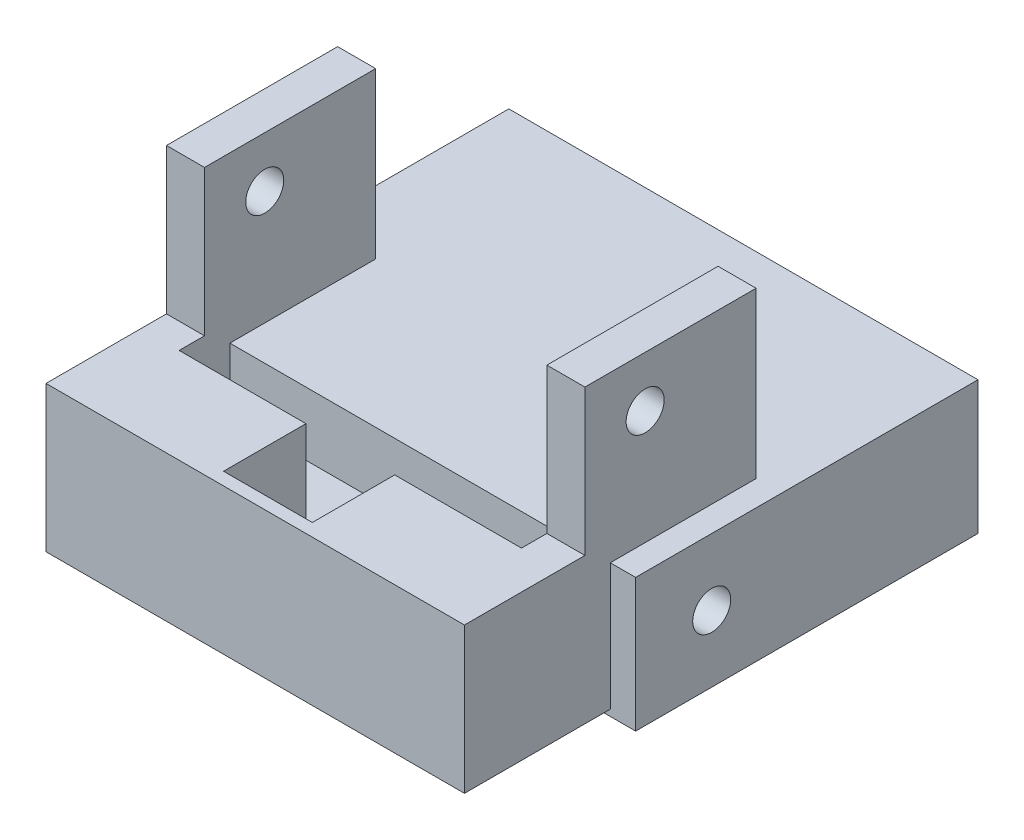
ISO-10303-21;
HEADER;
FILE_DESCRIPTION(('STEP AP214'),'2;1');
FILE_NAME('part.step','',(''),(''),'','','');
FILE_SCHEMA(('AUTOMOTIVE_DESIGN { 1 0 10303 214 1 1 1 1 }'));
ENDSEC;
DATA;
#1=APPLICATION_CONTEXT('core data for automotive mechanical design processes');
#2=APPLICATION_PROTOCOL_DEFINITION('international standard','automotive_design',2000,#1);
#3=PRODUCT_CONTEXT('',#1,'mechanical');
#4=PRODUCT('Part','Part','',(#3));
#5=PRODUCT_RELATED_PRODUCT_CATEGORY('part','',(#4));
#6=PRODUCT_DEFINITION_FORMATION('','',#4);
#7=PRODUCT_DEFINITION_CONTEXT('part definition',#1,'design');
#8=PRODUCT_DEFINITION('design','',#6,#7);
#9=PRODUCT_DEFINITION_SHAPE('','',#8);
#10=(LENGTH_UNIT() NAMED_UNIT(*) SI_UNIT(.MILLI.,.METRE.));
#11=(NAMED_UNIT(*) PLANE_ANGLE_UNIT() SI_UNIT($,.RADIAN.));
#12=(NAMED_UNIT(*) SI_UNIT($,.STERADIAN.) SOLID_ANGLE_UNIT());
#13=UNCERTAINTY_MEASURE_WITH_UNIT(LENGTH_MEASURE(1.E-05),#10,'distance_accuracy_value','');
#14=(GEOMETRIC_REPRESENTATION_CONTEXT(3) GLOBAL_UNCERTAINTY_ASSIGNED_CONTEXT((#13)) GLOBAL_UNIT_ASSIGNED_CONTEXT((#10,
#11,#12)) REPRESENTATION_CONTEXT('',''));
#15=CARTESIAN_POINT('',(0.,0.,0.));
#16=DIRECTION('',(0.,0.,1.));
#17=DIRECTION('',(1.,0.,0.));
#18=AXIS2_PLACEMENT_3D('',#15,#16,#17);
#19=CARTESIAN_POINT('',(558.894917120642,82.3157017452683,-224.056360518351));
#20=DIRECTION('',(-1.,0.,0.));
#21=DIRECTION('',(0.,0.,1.));
#22=AXIS2_PLACEMENT_3D('',#19,#20,#21);
#23=PLANE('',#22);
#24=DIRECTION('',(0.,0.,1.));
#25=VECTOR('',#24,1.);
#26=CARTESIAN_POINT('',(558.894917120642,85.3157017452683,-58.6570709718798));
#27=LINE('',#26,#25);
#28=CARTESIAN_POINT('',(558.894917120642,85.3157017452683,-224.056360518351));
#29=VERTEX_POINT('',#28);
#30=CARTESIAN_POINT('',(558.894917120642,85.3157017452683,-211.056360518351));
#31=VERTEX_POINT('',#30);
#32=EDGE_CURVE('E282',#29,#31,#27,.T.);
#33=ORIENTED_EDGE('',*,*,#32,.F.);
#34=DIRECTION('',(0.,1.,0.));
#35=VECTOR('',#34,1.);
#36=CARTESIAN_POINT('',(558.894917120642,82.3157017452683,-224.056360518351));
#37=LINE('',#36,#35);
#38=CARTESIAN_POINT('',(558.894917120642,72.3157017452683,-224.056360518351));
#39=VERTEX_POINT('',#38);
#40=EDGE_CURVE('E208',#39,#29,#37,.T.);
#41=ORIENTED_EDGE('',*,*,#40,.F.);
#42=DIRECTION('',(0.,0.,-1.));
#43=VECTOR('',#42,1.);
#44=CARTESIAN_POINT('',(558.894917120642,72.3157017452683,-213.504816335202));
#45=LINE('',#44,#43);
#46=CARTESIAN_POINT('',(558.894917120642,72.3157017452683,-211.056360518351));
#47=VERTEX_POINT('',#46);
#48=EDGE_CURVE('E200',#39,#47,#45,.F.);
#49=ORIENTED_EDGE('',*,*,#48,.T.);
#50=DIRECTION('',(0.,1.,0.));
#51=VECTOR('',#50,1.);
#52=CARTESIAN_POINT('',(558.894917120642,82.3157017452683,-211.056360518351));
#53=LINE('',#52,#51);
#54=EDGE_CURVE('E175',#31,#47,#53,.F.);
#55=ORIENTED_EDGE('',*,*,#54,.F.);
#56=EDGE_LOOP('',(#33,#41,#49,#55));
#57=FACE_BOUND('',#56,.T.);
#58=ADVANCED_FACE('F17',(#57),#23,.T.);
#59=CARTESIAN_POINT('',(558.894917120642,82.3157017452683,-211.056360518351));
#60=DIRECTION('',(0.,0.,-1.));
#61=DIRECTION('',(-1.,0.,0.));
#62=AXIS2_PLACEMENT_3D('',#59,#60,#61);
#63=PLANE('',#62);
#64=DIRECTION('',(0.,1.,0.));
#65=VECTOR('',#64,1.);
#66=CARTESIAN_POINT('',(544.894917120642,82.3157017452683,-211.056360518351));
#67=LINE('',#66,#65);
#68=CARTESIAN_POINT('',(544.894917120642,85.3157017452683,-211.056360518351));
#69=VERTEX_POINT('',#68);
#70=CARTESIAN_POINT('',(544.894917120642,72.3157017452683,-211.056360518351));
#71=VERTEX_POINT('',#70);
#72=EDGE_CURVE('E192',#69,#71,#67,.F.);
#73=ORIENTED_EDGE('',*,*,#72,.F.);
#74=DIRECTION('',(1.,0.,0.));
#75=VECTOR('',#74,1.);
#76=CARTESIAN_POINT('',(556.61416335875,85.3157017452683,-211.056360518351));
#77=LINE('',#76,#75);
#78=EDGE_CURVE('E280',#31,#69,#77,.F.);
#79=ORIENTED_EDGE('',*,*,#78,.F.);
#80=ORIENTED_EDGE('',*,*,#54,.T.);
#81=DIRECTION('',(1.,0.,0.));
#82=VECTOR('',#81,1.);
#83=CARTESIAN_POINT('',(580.438463796927,72.3157017452683,-211.056360518351));
#84=LINE('',#83,#82);
#85=EDGE_CURVE('E205',#47,#71,#84,.F.);
#86=ORIENTED_EDGE('',*,*,#85,.T.);
#87=EDGE_LOOP('',(#73,#79,#80,#86));
#88=FACE_BOUND('',#87,.T.);
#89=ADVANCED_FACE('F303',(#88),#63,.T.);
#90=CARTESIAN_POINT('',(544.894917120642,82.3157017452683,-211.056360518351));
#91=DIRECTION('',(1.,0.,0.));
#92=DIRECTION('',(0.,0.,-1.));
#93=AXIS2_PLACEMENT_3D('',#90,#91,#92);
#94=PLANE('',#93);
#95=DIRECTION('',(0.,0.,1.));
#96=VECTOR('',#95,1.);
#97=CARTESIAN_POINT('',(544.894917120642,85.3157017452683,-58.6570709718798));
#98=LINE('',#97,#96);
#99=CARTESIAN_POINT('',(544.894917120642,85.3157017452683,-224.056360518351));
#100=VERTEX_POINT('',#99);
#101=EDGE_CURVE('E278',#69,#100,#98,.F.);
#102=ORIENTED_EDGE('',*,*,#101,.F.);
#103=ORIENTED_EDGE('',*,*,#72,.T.);
#104=DIRECTION('',(0.,0.,-1.));
#105=VECTOR('',#104,1.);
#106=CARTESIAN_POINT('',(544.894917120642,72.3157017452683,-213.504816335202));
#107=LINE('',#106,#105);
#108=CARTESIAN_POINT('',(544.894917120642,72.3157017452683,-224.056360518351));
#109=VERTEX_POINT('',#108);
#110=EDGE_CURVE('E197',#71,#109,#107,.T.);
#111=ORIENTED_EDGE('',*,*,#110,.T.);
#112=DIRECTION('',(0.,1.,0.));
#113=VECTOR('',#112,1.);
#114=CARTESIAN_POINT('',(544.894917120642,82.3157017452683,-224.056360518351));
#115=LINE('',#114,#113);
#116=EDGE_CURVE('E182',#100,#109,#115,.F.);
#117=ORIENTED_EDGE('',*,*,#116,.F.);
#118=EDGE_LOOP('',(#102,#103,#111,#117));
#119=FACE_BOUND('',#118,.T.);
#120=ADVANCED_FACE('F202',(#119),#94,.T.);
#121=CARTESIAN_POINT('',(524.894917120642,82.3157017452683,-224.056360518351));
#122=DIRECTION('',(0.,0.,-1.));
#123=DIRECTION('',(-1.,0.,0.));
#124=AXIS2_PLACEMENT_3D('',#121,#122,#123);
#125=PLANE('',#124);
#126=DIRECTION('',(1.,0.,0.));
#127=VECTOR('',#126,1.);
#128=CARTESIAN_POINT('',(556.61416335875,85.3157017452683,-224.056360518351));
#129=LINE('',#128,#127);
#130=CARTESIAN_POINT('',(524.894917120642,85.3157017452683,-224.056360518351));
#131=VERTEX_POINT('',#130);
#132=EDGE_CURVE('E188',#100,#131,#129,.F.);
#133=ORIENTED_EDGE('',*,*,#132,.F.);
#134=ORIENTED_EDGE('',*,*,#116,.T.);
#135=DIRECTION('',(1.,0.,0.));
#136=VECTOR('',#135,1.);
#137=CARTESIAN_POINT('',(580.438463796927,72.3157017452683,-224.056360518351));
#138=LINE('',#137,#136);
#139=CARTESIAN_POINT('',(524.894917120642,72.3157017452683,-224.056360518351));
#140=VERTEX_POINT('',#139);
#141=EDGE_CURVE('E186',#109,#140,#138,.F.);
#142=ORIENTED_EDGE('',*,*,#141,.T.);
#143=DIRECTION('',(0.,1.,0.));
#144=VECTOR('',#143,1.);
#145=CARTESIAN_POINT('',(524.894917120642,82.3157017452683,-224.056360518351));
#146=LINE('',#145,#144);
#147=EDGE_CURVE('E255',#131,#140,#146,.F.);
#148=ORIENTED_EDGE('',*,*,#147,.F.);
#149=EDGE_LOOP('',(#133,#134,#142,#148));
#150=FACE_BOUND('',#149,.T.);
#151=ADVANCED_FACE('F184',(#150),#125,.T.);
#152=CARTESIAN_POINT('',(580.438463796927,72.3157017452683,-213.504816335202));
#153=DIRECTION('',(0.,-1.,0.));
#154=DIRECTION('',(0.,0.,-1.));
#155=AXIS2_PLACEMENT_3D('',#152,#153,#154);
#156=PLANE('',#155);
#157=ORIENTED_EDGE('',*,*,#85,.F.);
#158=ORIENTED_EDGE('',*,*,#48,.F.);
#159=DIRECTION('',(-1.,0.,0.));
#160=VECTOR('',#159,1.);
#161=CARTESIAN_POINT('',(578.894917120642,72.3157017452683,-224.056360518351));
#162=LINE('',#161,#160);
#163=CARTESIAN_POINT('',(578.894917120642,72.3157017452683,-224.056360518351));
#164=VERTEX_POINT('',#163);
#165=EDGE_CURVE('E204',#164,#39,#162,.T.);
#166=ORIENTED_EDGE('',*,*,#165,.F.);
#167=DIRECTION('',(0.,0.,1.));
#168=VECTOR('',#167,1.);
#169=CARTESIAN_POINT('',(578.894917120642,72.3157017452683,-228.056360518351));
#170=LINE('',#169,#168);
#171=CARTESIAN_POINT('',(578.894917120642,72.3157017452683,-232.056360518351));
#172=VERTEX_POINT('',#171);
#173=EDGE_CURVE('E354',#172,#164,#170,.T.);
#174=ORIENTED_EDGE('',*,*,#173,.F.);
#175=DIRECTION('',(1.,0.,0.));
#176=VECTOR('',#175,1.);
#177=CARTESIAN_POINT('',(514.894917120642,72.3157017452683,-232.056360518351));
#178=LINE('',#177,#176);
#179=CARTESIAN_POINT('',(524.894917120642,72.3157017452683,-232.056360518351));
#180=VERTEX_POINT('',#179);
#181=EDGE_CURVE('E246',#180,#172,#178,.T.);
#182=ORIENTED_EDGE('',*,*,#181,.F.);
#183=DIRECTION('',(0.,0.,-1.));
#184=VECTOR('',#183,1.);
#185=CARTESIAN_POINT('',(524.894917120642,72.3157017452683,-255.056360518351));
#186=LINE('',#185,#184);
#187=EDGE_CURVE('E199',#140,#180,#186,.T.);
#188=ORIENTED_EDGE('',*,*,#187,.F.);
#189=ORIENTED_EDGE('',*,*,#141,.F.);
#190=ORIENTED_EDGE('',*,*,#110,.F.);
#191=EDGE_LOOP('',(#157,#158,#166,#174,#182,#188,#189,#190));
#192=FACE_BOUND('',#191,.T.);
#193=ADVANCED_FACE('F196',(#192),#156,.F.);
#194=CARTESIAN_POINT('',(578.894917120642,82.3157017452683,-224.056360518351));
#195=DIRECTION('',(0.,0.,-1.));
#196=DIRECTION('',(-1.,0.,0.));
#197=AXIS2_PLACEMENT_3D('',#194,#195,#196);
#198=PLANE('',#197);
#199=DIRECTION('',(1.,0.,0.));
#200=VECTOR('',#199,1.);
#201=CARTESIAN_POINT('',(556.61416335875,85.3157017452683,-224.056360518351));
#202=LINE('',#201,#200);
#203=CARTESIAN_POINT('',(578.894917120642,85.3157017452683,-224.056360518351));
#204=VERTEX_POINT('',#203);
#205=EDGE_CURVE('E284',#204,#29,#202,.F.);
#206=ORIENTED_EDGE('',*,*,#205,.F.);
#207=DIRECTION('',(0.,1.,0.));
#208=VECTOR('',#207,1.);
#209=CARTESIAN_POINT('',(578.894917120642,82.3157017452683,-224.056360518351));
#210=LINE('',#209,#208);
#211=EDGE_CURVE('E352',#164,#204,#210,.T.);
#212=ORIENTED_EDGE('',*,*,#211,.F.);
#213=ORIENTED_EDGE('',*,*,#165,.T.);
#214=ORIENTED_EDGE('',*,*,#40,.T.);
#215=EDGE_LOOP('',(#206,#212,#213,#214));
#216=FACE_BOUND('',#215,.T.);
#217=ADVANCED_FACE('F293',(#216),#198,.T.);
#218=CARTESIAN_POINT('',(507.494893120642,100.315701745268,-237.556360518351));
#219=DIRECTION('',(1.,0.,0.));
#220=DIRECTION('',(0.,0.,-1.));
#221=AXIS2_PLACEMENT_3D('',#218,#219,#220);
#222=CYLINDRICAL_SURFACE('',#221,3.);
#223=CARTESIAN_POINT('',(578.894917120642,100.315701745268,-237.556360518351));
#224=DIRECTION('',(1.,0.,0.));
#225=DIRECTION('',(0.,0.,-1.));
#226=AXIS2_PLACEMENT_3D('',#223,#224,#225);
#227=CIRCLE('',#226,3.);
#228=CARTESIAN_POINT('',(578.894917120642,100.315701745268,-240.556360518351));
#229=VERTEX_POINT('',#228);
#230=EDGE_CURVE('E236',#229,#229,#227,.T.);
#231=ORIENTED_EDGE('',*,*,#230,.F.);
#232=EDGE_LOOP('',(#231));
#233=FACE_BOUND('',#232,.T.);
#234=CARTESIAN_POINT('',(584.894917120642,100.315701745268,-237.556360518351));
#235=DIRECTION('',(1.,0.,0.));
#236=DIRECTION('',(0.,0.,-1.));
#237=AXIS2_PLACEMENT_3D('',#234,#235,#236);
#238=CIRCLE('',#237,3.);
#239=CARTESIAN_POINT('',(584.894917120642,100.315701745268,-240.556360518351));
#240=VERTEX_POINT('',#239);
#241=EDGE_CURVE('E232',#240,#240,#238,.F.);
#242=ORIENTED_EDGE('',*,*,#241,.F.);
#243=EDGE_LOOP('',(#242));
#244=FACE_BOUND('',#243,.T.);
#245=ADVANCED_FACE('F523',(#233,#244),#222,.F.);
#246=CARTESIAN_POINT('',(314.61416335875,108.315701745268,-58.6570709718798));
#247=DIRECTION('',(0.,1.,0.));
#248=DIRECTION('',(0.,0.,1.));
#249=AXIS2_PLACEMENT_3D('',#246,#247,#248);
#250=PLANE('',#249);
#251=DIRECTION('',(0.,0.,-1.));
#252=VECTOR('',#251,1.);
#253=CARTESIAN_POINT('',(584.894917120642,108.315701745268,-255.056360518351));
#254=LINE('',#253,#252);
#255=CARTESIAN_POINT('',(584.894917120642,108.315701745268,-255.056360518351));
#256=VERTEX_POINT('',#255);
#257=CARTESIAN_POINT('',(584.894917120642,108.315701745268,-228.056360518351));
#258=VERTEX_POINT('',#257);
#259=EDGE_CURVE('E341',#256,#258,#254,.F.);
#260=ORIENTED_EDGE('',*,*,#259,.F.);
#261=DIRECTION('',(-1.,0.,0.));
#262=VECTOR('',#261,1.);
#263=CARTESIAN_POINT('',(578.894917120642,108.315701745268,-255.056360518351));
#264=LINE('',#263,#262);
#265=CARTESIAN_POINT('',(578.894917120642,108.315701745268,-255.056360518351));
#266=VERTEX_POINT('',#265);
#267=EDGE_CURVE('E235',#266,#256,#264,.F.);
#268=ORIENTED_EDGE('',*,*,#267,.F.);
#269=DIRECTION('',(0.,0.,1.));
#270=VECTOR('',#269,1.);
#271=CARTESIAN_POINT('',(578.894917120642,108.315701745268,-228.056360518351));
#272=LINE('',#271,#270);
#273=CARTESIAN_POINT('',(578.894917120642,108.315701745268,-228.056360518351));
#274=VERTEX_POINT('',#273);
#275=EDGE_CURVE('E243',#274,#266,#272,.F.);
#276=ORIENTED_EDGE('',*,*,#275,.F.);
#277=DIRECTION('',(1.,0.,0.));
#278=VECTOR('',#277,1.);
#279=CARTESIAN_POINT('',(584.894917120642,108.315701745268,-228.056360518351));
#280=LINE('',#279,#278);
#281=EDGE_CURVE('E289',#258,#274,#280,.F.);
#282=ORIENTED_EDGE('',*,*,#281,.F.);
#283=EDGE_LOOP('',(#260,#268,#276,#282));
#284=FACE_BOUND('',#283,.T.);
#285=ADVANCED_FACE('F373',(#284),#250,.T.);
#286=CARTESIAN_POINT('',(584.894917120642,82.3157017452683,-228.056360518351));
#287=DIRECTION('',(0.,0.,1.));
#288=DIRECTION('',(1.,0.,0.));
#289=AXIS2_PLACEMENT_3D('',#286,#287,#288);
#290=PLANE('',#289);
#291=ORIENTED_EDGE('',*,*,#281,.T.);
#292=DIRECTION('',(0.,1.,0.));
#293=VECTOR('',#292,1.);
#294=CARTESIAN_POINT('',(578.894917120642,82.3157017452683,-228.056360518351));
#295=LINE('',#294,#293);
#296=CARTESIAN_POINT('',(578.894917120642,85.3157017452683,-228.056360518351));
#297=VERTEX_POINT('',#296);
#298=EDGE_CURVE('E238',#297,#274,#295,.T.);
#299=ORIENTED_EDGE('',*,*,#298,.F.);
#300=DIRECTION('',(1.,0.,0.));
#301=VECTOR('',#300,1.);
#302=CARTESIAN_POINT('',(556.61416335875,85.3157017452683,-228.056360518351));
#303=LINE('',#302,#301);
#304=CARTESIAN_POINT('',(584.894917120642,85.3157017452683,-228.056360518351));
#305=VERTEX_POINT('',#304);
#306=EDGE_CURVE('E287',#305,#297,#303,.F.);
#307=ORIENTED_EDGE('',*,*,#306,.F.);
#308=DIRECTION('',(0.,1.,0.));
#309=VECTOR('',#308,1.);
#310=CARTESIAN_POINT('',(584.894917120642,82.3157017452683,-228.056360518351));
#311=LINE('',#310,#309);
#312=EDGE_CURVE('E339',#258,#305,#311,.F.);
#313=ORIENTED_EDGE('',*,*,#312,.F.);
#314=EDGE_LOOP('',(#291,#299,#307,#313));
#315=FACE_BOUND('',#314,.T.);
#316=ADVANCED_FACE('F516',(#315),#290,.T.);
#317=CARTESIAN_POINT('',(507.494893120642,100.315701745268,-237.556360518351));
#318=DIRECTION('',(1.,0.,0.));
#319=DIRECTION('',(0.,0.,-1.));
#320=AXIS2_PLACEMENT_3D('',#317,#318,#319);
#321=CYLINDRICAL_SURFACE('',#320,3.);
#322=CARTESIAN_POINT('',(518.894917120642,100.315701745268,-237.556360518351));
#323=DIRECTION('',(1.,0.,0.));
#324=DIRECTION('',(0.,0.,-1.));
#325=AXIS2_PLACEMENT_3D('',#322,#323,#324);
#326=CIRCLE('',#325,3.);
#327=CARTESIAN_POINT('',(518.894917120642,100.315701745268,-240.556360518351));
#328=VERTEX_POINT('',#327);
#329=EDGE_CURVE('E227',#328,#328,#326,.T.);
#330=ORIENTED_EDGE('',*,*,#329,.F.);
#331=EDGE_LOOP('',(#330));
#332=FACE_BOUND('',#331,.T.);
#333=CARTESIAN_POINT('',(524.894917120642,100.315701745268,-237.556360518351));
#334=DIRECTION('',(1.,0.,0.));
#335=DIRECTION('',(0.,0.,-1.));
#336=AXIS2_PLACEMENT_3D('',#333,#334,#335);
#337=CIRCLE('',#336,3.);
#338=CARTESIAN_POINT('',(524.894917120642,100.315701745268,-240.556360518351));
#339=VERTEX_POINT('',#338);
#340=EDGE_CURVE('E20',#339,#339,#337,.F.);
#341=ORIENTED_EDGE('',*,*,#340,.F.);
#342=EDGE_LOOP('',(#341));
#343=FACE_BOUND('',#342,.T.);
#344=ADVANCED_FACE('F512',(#332,#343),#321,.F.);
#345=CARTESIAN_POINT('',(584.894917120642,82.3157017452683,-209.056360518351));
#346=DIRECTION('',(0.,0.,1.));
#347=DIRECTION('',(1.,0.,0.));
#348=AXIS2_PLACEMENT_3D('',#345,#346,#347);
#349=PLANE('',#348);
#350=DIRECTION('',(0.,1.,0.));
#351=VECTOR('',#350,1.);
#352=CARTESIAN_POINT('',(584.894917120642,82.3157017452683,-209.056360518351));
#353=LINE('',#352,#351);
#354=CARTESIAN_POINT('',(584.894917120642,85.3157017452683,-209.056360518351));
#355=VERTEX_POINT('',#354);
#356=CARTESIAN_POINT('',(584.894917120642,62.3157017452683,-209.056360518351));
#357=VERTEX_POINT('',#356);
#358=EDGE_CURVE('E234',#355,#357,#353,.F.);
#359=ORIENTED_EDGE('',*,*,#358,.F.);
#360=DIRECTION('',(1.,0.,0.));
#361=VECTOR('',#360,1.);
#362=CARTESIAN_POINT('',(556.61416335875,85.3157017452683,-209.056360518351));
#363=LINE('',#362,#361);
#364=CARTESIAN_POINT('',(518.894917120642,85.3157017452683,-209.056360518351));
#365=VERTEX_POINT('',#364);
#366=EDGE_CURVE('E275',#365,#355,#363,.T.);
#367=ORIENTED_EDGE('',*,*,#366,.F.);
#368=DIRECTION('',(0.,1.,0.));
#369=VECTOR('',#368,1.);
#370=CARTESIAN_POINT('',(518.894917120642,82.3157017452683,-209.056360518351));
#371=LINE('',#370,#369);
#372=CARTESIAN_POINT('',(518.894917120642,62.3157017452683,-209.056360518351));
#373=VERTEX_POINT('',#372);
#374=EDGE_CURVE('E323',#373,#365,#371,.T.);
#375=ORIENTED_EDGE('',*,*,#374,.F.);
#376=DIRECTION('',(1.,0.,0.));
#377=VECTOR('',#376,1.);
#378=CARTESIAN_POINT('',(556.61416335875,62.3157017452683,-209.056360518351));
#379=LINE('',#378,#377);
#380=EDGE_CURVE('E334',#373,#357,#379,.T.);
#381=ORIENTED_EDGE('',*,*,#380,.T.);
#382=EDGE_LOOP('',(#359,#367,#375,#381));
#383=FACE_BOUND('',#382,.T.);
#384=ADVANCED_FACE('F509',(#383),#349,.T.);
#385=CARTESIAN_POINT('',(556.61416335875,85.3157017452683,-58.6570709718798));
#386=DIRECTION('',(0.,1.,0.));
#387=DIRECTION('',(0.,0.,1.));
#388=AXIS2_PLACEMENT_3D('',#385,#386,#387);
#389=PLANE('',#388);
#390=ORIENTED_EDGE('',*,*,#366,.T.);
#391=DIRECTION('',(0.,0.,-1.));
#392=VECTOR('',#391,1.);
#393=CARTESIAN_POINT('',(584.894917120642,85.3157017452683,-255.056360518351));
#394=LINE('',#393,#392);
#395=EDGE_CURVE('E337',#305,#355,#394,.F.);
#396=ORIENTED_EDGE('',*,*,#395,.F.);
#397=ORIENTED_EDGE('',*,*,#306,.T.);
#398=DIRECTION('',(0.,0.,1.));
#399=VECTOR('',#398,1.);
#400=CARTESIAN_POINT('',(578.894917120642,85.3157017452683,-228.056360518351));
#401=LINE('',#400,#399);
#402=EDGE_CURVE('E302',#204,#297,#401,.F.);
#403=ORIENTED_EDGE('',*,*,#402,.F.);
#404=ORIENTED_EDGE('',*,*,#205,.T.);
#405=ORIENTED_EDGE('',*,*,#32,.T.);
#406=ORIENTED_EDGE('',*,*,#78,.T.);
#407=ORIENTED_EDGE('',*,*,#101,.T.);
#408=ORIENTED_EDGE('',*,*,#132,.T.);
#409=DIRECTION('',(0.,0.,-1.));
#410=VECTOR('',#409,1.);
#411=CARTESIAN_POINT('',(524.894917120642,85.3157017452683,-255.056360518351));
#412=LINE('',#411,#410);
#413=CARTESIAN_POINT('',(524.894917120642,85.3157017452683,-228.056360518351));
#414=VERTEX_POINT('',#413);
#415=EDGE_CURVE('E257',#414,#131,#412,.F.);
#416=ORIENTED_EDGE('',*,*,#415,.F.);
#417=DIRECTION('',(1.,0.,0.));
#418=VECTOR('',#417,1.);
#419=CARTESIAN_POINT('',(524.894917120642,85.3157017452683,-228.056360518351));
#420=LINE('',#419,#418);
#421=CARTESIAN_POINT('',(518.894917120642,85.3157017452683,-228.056360518351));
#422=VERTEX_POINT('',#421);
#423=EDGE_CURVE('E273',#422,#414,#420,.T.);
#424=ORIENTED_EDGE('',*,*,#423,.F.);
#425=DIRECTION('',(0.,0.,1.));
#426=VECTOR('',#425,1.);
#427=CARTESIAN_POINT('',(518.894917120642,85.3157017452683,-228.056360518351));
#428=LINE('',#427,#426);
#429=EDGE_CURVE('E318',#365,#422,#428,.F.);
#430=ORIENTED_EDGE('',*,*,#429,.F.);
#431=EDGE_LOOP('',(#390,#396,#397,#403,#404,#405,#406,#407,#408,#416,#424,#430));
#432=FACE_BOUND('',#431,.T.);
#433=ADVANCED_FACE('F300',(#432),#389,.T.);
#434=CARTESIAN_POINT('',(524.894917120642,82.3157017452683,-228.056360518351));
#435=DIRECTION('',(0.,0.,1.));
#436=DIRECTION('',(1.,0.,0.));
#437=AXIS2_PLACEMENT_3D('',#434,#435,#436);
#438=PLANE('',#437);
#439=DIRECTION('',(1.,0.,0.));
#440=VECTOR('',#439,1.);
#441=CARTESIAN_POINT('',(314.61416335875,108.315701745268,-228.056360518351));
#442=LINE('',#441,#440);
#443=CARTESIAN_POINT('',(518.894917120642,108.315701745268,-228.056360518351));
#444=VERTEX_POINT('',#443);
#445=CARTESIAN_POINT('',(524.894917120642,108.315701745268,-228.056360518351));
#446=VERTEX_POINT('',#445);
#447=EDGE_CURVE('E271',#444,#446,#442,.T.);
#448=ORIENTED_EDGE('',*,*,#447,.F.);
#449=DIRECTION('',(0.,1.,0.));
#450=VECTOR('',#449,1.);
#451=CARTESIAN_POINT('',(518.894917120642,82.3157017452683,-228.056360518351));
#452=LINE('',#451,#450);
#453=EDGE_CURVE('E316',#422,#444,#452,.T.);
#454=ORIENTED_EDGE('',*,*,#453,.F.);
#455=ORIENTED_EDGE('',*,*,#423,.T.);
#456=DIRECTION('',(0.,1.,0.));
#457=VECTOR('',#456,1.);
#458=CARTESIAN_POINT('',(524.894917120642,82.3157017452683,-228.056360518351));
#459=LINE('',#458,#457);
#460=EDGE_CURVE('E260',#446,#414,#459,.F.);
#461=ORIENTED_EDGE('',*,*,#460,.F.);
#462=EDGE_LOOP('',(#448,#454,#455,#461));
#463=FACE_BOUND('',#462,.T.);
#464=ADVANCED_FACE('F313',(#463),#438,.T.);
#465=CARTESIAN_POINT('',(314.61416335875,108.315701745268,-58.6570709718798));
#466=DIRECTION('',(0.,1.,0.));
#467=DIRECTION('',(0.,0.,1.));
#468=AXIS2_PLACEMENT_3D('',#465,#466,#467);
#469=PLANE('',#468);
#470=ORIENTED_EDGE('',*,*,#447,.T.);
#471=DIRECTION('',(0.,0.,-1.));
#472=VECTOR('',#471,1.);
#473=CARTESIAN_POINT('',(524.894917120642,108.315701745268,-255.056360518351));
#474=LINE('',#473,#472);
#475=CARTESIAN_POINT('',(524.894917120642,108.315701745268,-255.056360518351));
#476=VERTEX_POINT('',#475);
#477=EDGE_CURVE('E263',#476,#446,#474,.F.);
#478=ORIENTED_EDGE('',*,*,#477,.F.);
#479=DIRECTION('',(-1.,0.,0.));
#480=VECTOR('',#479,1.);
#481=CARTESIAN_POINT('',(518.894917120642,108.315701745268,-255.056360518351));
#482=LINE('',#481,#480);
#483=CARTESIAN_POINT('',(518.894917120642,108.315701745268,-255.056360518351));
#484=VERTEX_POINT('',#483);
#485=EDGE_CURVE('E269',#484,#476,#482,.F.);
#486=ORIENTED_EDGE('',*,*,#485,.F.);
#487=DIRECTION('',(0.,0.,1.));
#488=VECTOR('',#487,1.);
#489=CARTESIAN_POINT('',(518.894917120642,108.315701745268,-228.056360518351));
#490=LINE('',#489,#488);
#491=EDGE_CURVE('E325',#444,#484,#490,.F.);
#492=ORIENTED_EDGE('',*,*,#491,.F.);
#493=EDGE_LOOP('',(#470,#478,#486,#492));
#494=FACE_BOUND('',#493,.T.);
#495=ADVANCED_FACE('F408',(#494),#469,.T.);
#496=CARTESIAN_POINT('',(518.894917120642,82.3157017452683,-255.056360518351));
#497=DIRECTION('',(0.,0.,-1.));
#498=DIRECTION('',(-1.,0.,0.));
#499=AXIS2_PLACEMENT_3D('',#496,#497,#498);
#500=PLANE('',#499);
#501=DIRECTION('',(0.,1.,0.));
#502=VECTOR('',#501,1.);
#503=CARTESIAN_POINT('',(524.894917120642,82.3157017452683,-255.056360518351));
#504=LINE('',#503,#502);
#505=CARTESIAN_POINT('',(524.894917120642,82.3157017452683,-255.056360518351));
#506=VERTEX_POINT('',#505);
#507=EDGE_CURVE('E266',#506,#476,#504,.T.);
#508=ORIENTED_EDGE('',*,*,#507,.F.);
#509=DIRECTION('',(1.,0.,0.));
#510=VECTOR('',#509,1.);
#511=CARTESIAN_POINT('',(556.61416335875,82.3157017452683,-255.056360518351));
#512=LINE('',#511,#510);
#513=CARTESIAN_POINT('',(518.894917120642,82.3157017452683,-255.056360518351));
#514=VERTEX_POINT('',#513);
#515=EDGE_CURVE('E397',#514,#506,#512,.T.);
#516=ORIENTED_EDGE('',*,*,#515,.F.);
#517=DIRECTION('',(0.,1.,0.));
#518=VECTOR('',#517,1.);
#519=CARTESIAN_POINT('',(518.894917120642,82.3157017452683,-255.056360518351));
#520=LINE('',#519,#518);
#521=EDGE_CURVE('E402',#484,#514,#520,.F.);
#522=ORIENTED_EDGE('',*,*,#521,.F.);
#523=ORIENTED_EDGE('',*,*,#485,.T.);
#524=EDGE_LOOP('',(#508,#516,#522,#523));
#525=FACE_BOUND('',#524,.T.);
#526=ADVANCED_FACE('F412',(#525),#500,.T.);
#527=CARTESIAN_POINT('',(524.894917120642,82.3157017452683,-255.056360518351));
#528=DIRECTION('',(1.,0.,0.));
#529=DIRECTION('',(0.,0.,-1.));
#530=AXIS2_PLACEMENT_3D('',#527,#528,#529);
#531=PLANE('',#530);
#532=DIRECTION('',(0.,1.,0.));
#533=VECTOR('',#532,1.);
#534=CARTESIAN_POINT('',(524.894917120642,82.3157017452683,-232.056360518351));
#535=LINE('',#534,#533);
#536=CARTESIAN_POINT('',(524.894917120642,82.3157017452683,-232.056360518351));
#537=VERTEX_POINT('',#536);
#538=EDGE_CURVE('E239',#537,#180,#535,.F.);
#539=ORIENTED_EDGE('',*,*,#538,.F.);
#540=DIRECTION('',(0.,0.,1.));
#541=VECTOR('',#540,1.);
#542=CARTESIAN_POINT('',(524.894917120642,82.3157017452683,-58.6570709718798));
#543=LINE('',#542,#541);
#544=EDGE_CURVE('E395',#506,#537,#543,.T.);
#545=ORIENTED_EDGE('',*,*,#544,.F.);
#546=ORIENTED_EDGE('',*,*,#507,.T.);
#547=ORIENTED_EDGE('',*,*,#477,.T.);
#548=ORIENTED_EDGE('',*,*,#460,.T.);
#549=ORIENTED_EDGE('',*,*,#415,.T.);
#550=ORIENTED_EDGE('',*,*,#147,.T.);
#551=ORIENTED_EDGE('',*,*,#187,.T.);
#552=EDGE_LOOP('',(#539,#545,#546,#547,#548,#549,#550,#551));
#553=FACE_BOUND('',#552,.T.);
#554=ORIENTED_EDGE('',*,*,#340,.T.);
#555=EDGE_LOOP('',(#554));
#556=FACE_BOUND('',#555,.T.);
#557=ADVANCED_FACE('F307',(#553,#556),#531,.T.);
#558=CARTESIAN_POINT('',(514.894917120642,82.3157017452683,-232.056360518351));
#559=DIRECTION('',(0.,0.,1.));
#560=DIRECTION('',(1.,0.,0.));
#561=AXIS2_PLACEMENT_3D('',#558,#559,#560);
#562=PLANE('',#561);
#563=DIRECTION('',(1.,0.,0.));
#564=VECTOR('',#563,1.);
#565=CARTESIAN_POINT('',(556.61416335875,82.3157017452683,-232.056360518351));
#566=LINE('',#565,#564);
#567=CARTESIAN_POINT('',(578.894917120642,82.3157017452683,-232.056360518351));
#568=VERTEX_POINT('',#567);
#569=EDGE_CURVE('E393',#537,#568,#566,.T.);
#570=ORIENTED_EDGE('',*,*,#569,.F.);
#571=ORIENTED_EDGE('',*,*,#538,.T.);
#572=ORIENTED_EDGE('',*,*,#181,.T.);
#573=DIRECTION('',(0.,1.,0.));
#574=VECTOR('',#573,1.);
#575=CARTESIAN_POINT('',(578.894917120642,82.3157017452683,-232.056360518351));
#576=LINE('',#575,#574);
#577=EDGE_CURVE('E356',#568,#172,#576,.F.);
#578=ORIENTED_EDGE('',*,*,#577,.F.);
#579=EDGE_LOOP('',(#570,#571,#572,#578));
#580=FACE_BOUND('',#579,.T.);
#581=ADVANCED_FACE('F496',(#580),#562,.T.);
#582=CARTESIAN_POINT('',(578.894917120642,82.3157017452683,-228.056360518351));
#583=DIRECTION('',(-1.,0.,0.));
#584=DIRECTION('',(0.,0.,1.));
#585=AXIS2_PLACEMENT_3D('',#582,#583,#584);
#586=PLANE('',#585);
#587=ORIENTED_EDGE('',*,*,#211,.T.);
#588=ORIENTED_EDGE('',*,*,#402,.T.);
#589=ORIENTED_EDGE('',*,*,#298,.T.);
#590=ORIENTED_EDGE('',*,*,#275,.T.);
#591=DIRECTION('',(0.,1.,0.));
#592=VECTOR('',#591,1.);
#593=CARTESIAN_POINT('',(578.894917120642,82.3157017452683,-255.056360518351));
#594=LINE('',#593,#592);
#595=CARTESIAN_POINT('',(578.894917120642,82.3157017452683,-255.056360518351));
#596=VERTEX_POINT('',#595);
#597=EDGE_CURVE('E348',#596,#266,#594,.T.);
#598=ORIENTED_EDGE('',*,*,#597,.F.);
#599=DIRECTION('',(0.,0.,1.));
#600=VECTOR('',#599,1.);
#601=CARTESIAN_POINT('',(578.894917120642,82.3157017452683,-58.6570709718798));
#602=LINE('',#601,#600);
#603=EDGE_CURVE('E388',#568,#596,#602,.F.);
#604=ORIENTED_EDGE('',*,*,#603,.F.);
#605=ORIENTED_EDGE('',*,*,#577,.T.);
#606=ORIENTED_EDGE('',*,*,#173,.T.);
#607=EDGE_LOOP('',(#587,#588,#589,#590,#598,#604,#605,#606));
#608=FACE_BOUND('',#607,.T.);
#609=ORIENTED_EDGE('',*,*,#230,.T.);
#610=EDGE_LOOP('',(#609));
#611=FACE_BOUND('',#610,.T.);
#612=ADVANCED_FACE('F361',(#608,#611),#586,.T.);
#613=CARTESIAN_POINT('',(578.894917120642,82.3157017452683,-255.056360518351));
#614=DIRECTION('',(0.,0.,-1.));
#615=DIRECTION('',(-1.,0.,0.));
#616=AXIS2_PLACEMENT_3D('',#613,#614,#615);
#617=PLANE('',#616);
#618=DIRECTION('',(0.,1.,0.));
#619=VECTOR('',#618,1.);
#620=CARTESIAN_POINT('',(584.894917120642,82.3157017452683,-255.056360518351));
#621=LINE('',#620,#619);
#622=CARTESIAN_POINT('',(584.894917120642,82.3157017452683,-255.056360518351));
#623=VERTEX_POINT('',#622);
#624=EDGE_CURVE('E343',#623,#256,#621,.T.);
#625=ORIENTED_EDGE('',*,*,#624,.F.);
#626=DIRECTION('',(1.,0.,0.));
#627=VECTOR('',#626,1.);
#628=CARTESIAN_POINT('',(556.61416335875,82.3157017452683,-255.056360518351));
#629=LINE('',#628,#627);
#630=EDGE_CURVE('E371',#596,#623,#629,.T.);
#631=ORIENTED_EDGE('',*,*,#630,.F.);
#632=ORIENTED_EDGE('',*,*,#597,.T.);
#633=ORIENTED_EDGE('',*,*,#267,.T.);
#634=EDGE_LOOP('',(#625,#631,#632,#633));
#635=FACE_BOUND('',#634,.T.);
#636=ADVANCED_FACE('F370',(#635),#617,.T.);
#637=CARTESIAN_POINT('',(584.894917120642,82.3157017452683,-255.056360518351));
#638=DIRECTION('',(1.,0.,0.));
#639=DIRECTION('',(0.,0.,-1.));
#640=AXIS2_PLACEMENT_3D('',#637,#638,#639);
#641=PLANE('',#640);
#642=ORIENTED_EDGE('',*,*,#312,.T.);
#643=ORIENTED_EDGE('',*,*,#395,.T.);
#644=ORIENTED_EDGE('',*,*,#358,.T.);
#645=DIRECTION('',(0.,0.,1.));
#646=VECTOR('',#645,1.);
#647=CARTESIAN_POINT('',(584.894917120642,62.3157017452683,-58.6570709718798));
#648=LINE('',#647,#646);
#649=CARTESIAN_POINT('',(584.894917120642,62.3157017452683,-232.056360518351));
#650=VERTEX_POINT('',#649);
#651=EDGE_CURVE('E231',#357,#650,#648,.F.);
#652=ORIENTED_EDGE('',*,*,#651,.T.);
#653=DIRECTION('',(0.,1.,0.));
#654=VECTOR('',#653,1.);
#655=CARTESIAN_POINT('',(584.894917120642,82.3157017452683,-232.056360518351));
#656=LINE('',#655,#654);
#657=CARTESIAN_POINT('',(584.894917120642,82.3157017452683,-232.056360518351));
#658=VERTEX_POINT('',#657);
#659=EDGE_CURVE('E382',#658,#650,#656,.F.);
#660=ORIENTED_EDGE('',*,*,#659,.F.);
#661=DIRECTION('',(0.,0.,1.));
#662=VECTOR('',#661,1.);
#663=CARTESIAN_POINT('',(584.894917120642,82.3157017452683,-58.6570709718798));
#664=LINE('',#663,#662);
#665=EDGE_CURVE('E381',#623,#658,#664,.T.);
#666=ORIENTED_EDGE('',*,*,#665,.F.);
#667=ORIENTED_EDGE('',*,*,#624,.T.);
#668=ORIENTED_EDGE('',*,*,#259,.T.);
#669=EDGE_LOOP('',(#642,#643,#644,#652,#660,#666,#667,#668));
#670=FACE_BOUND('',#669,.T.);
#671=ORIENTED_EDGE('',*,*,#241,.T.);
#672=EDGE_LOOP('',(#671));
#673=FACE_BOUND('',#672,.T.);
#674=ADVANCED_FACE('F376',(#670,#673),#641,.T.);
#675=CARTESIAN_POINT('',(556.61416335875,62.3157017452683,-58.6570709718798));
#676=DIRECTION('',(0.,1.,0.));
#677=DIRECTION('',(0.,0.,1.));
#678=AXIS2_PLACEMENT_3D('',#675,#676,#677);
#679=PLANE('',#678);
#680=ORIENTED_EDGE('',*,*,#651,.F.);
#681=ORIENTED_EDGE('',*,*,#380,.F.);
#682=DIRECTION('',(0.,0.,1.));
#683=VECTOR('',#682,1.);
#684=CARTESIAN_POINT('',(518.894917120642,62.3157017452683,-228.056360518351));
#685=LINE('',#684,#683);
#686=CARTESIAN_POINT('',(518.894917120642,62.3157017452683,-232.056360518351));
#687=VERTEX_POINT('',#686);
#688=EDGE_CURVE('E230',#687,#373,#685,.T.);
#689=ORIENTED_EDGE('',*,*,#688,.F.);
#690=DIRECTION('',(1.,0.,0.));
#691=VECTOR('',#690,1.);
#692=CARTESIAN_POINT('',(514.894917120642,62.3157017452683,-232.056360518351));
#693=LINE('',#692,#691);
#694=EDGE_CURVE('E423',#650,#687,#693,.F.);
#695=ORIENTED_EDGE('',*,*,#694,.F.);
#696=EDGE_LOOP('',(#680,#681,#689,#695));
#697=FACE_BOUND('',#696,.T.);
#698=ADVANCED_FACE('F486',(#697),#679,.F.);
#699=CARTESIAN_POINT('',(518.894917120642,82.3157017452683,-228.056360518351));
#700=DIRECTION('',(-1.,0.,0.));
#701=DIRECTION('',(0.,0.,1.));
#702=AXIS2_PLACEMENT_3D('',#699,#700,#701);
#703=PLANE('',#702);
#704=ORIENTED_EDGE('',*,*,#521,.T.);
#705=DIRECTION('',(0.,0.,1.));
#706=VECTOR('',#705,1.);
#707=CARTESIAN_POINT('',(518.894917120642,82.3157017452683,-58.6570709718798));
#708=LINE('',#707,#706);
#709=CARTESIAN_POINT('',(518.894917120642,82.3157017452683,-232.056360518351));
#710=VERTEX_POINT('',#709);
#711=EDGE_CURVE('E399',#710,#514,#708,.F.);
#712=ORIENTED_EDGE('',*,*,#711,.F.);
#713=DIRECTION('',(0.,1.,0.));
#714=VECTOR('',#713,1.);
#715=CARTESIAN_POINT('',(518.894917120642,82.3157017452683,-232.056360518351));
#716=LINE('',#715,#714);
#717=EDGE_CURVE('E221',#687,#710,#716,.T.);
#718=ORIENTED_EDGE('',*,*,#717,.F.);
#719=ORIENTED_EDGE('',*,*,#688,.T.);
#720=ORIENTED_EDGE('',*,*,#374,.T.);
#721=ORIENTED_EDGE('',*,*,#429,.T.);
#722=ORIENTED_EDGE('',*,*,#453,.T.);
#723=ORIENTED_EDGE('',*,*,#491,.T.);
#724=EDGE_LOOP('',(#704,#712,#718,#719,#720,#721,#722,#723));
#725=FACE_BOUND('',#724,.T.);
#726=ORIENTED_EDGE('',*,*,#329,.T.);
#727=EDGE_LOOP('',(#726));
#728=FACE_BOUND('',#727,.T.);
#729=ADVANCED_FACE('F404',(#725,#728),#703,.T.);
#730=CARTESIAN_POINT('',(596.294941120642,71.8157017452683,-244.056360518351));
#731=DIRECTION('',(-1.,0.,0.));
#732=DIRECTION('',(0.,0.,1.));
#733=AXIS2_PLACEMENT_3D('',#730,#731,#732);
#734=CYLINDRICAL_SURFACE('',#733,3.);
#735=CARTESIAN_POINT('',(588.894917120642,71.8157017452683,-244.056360518351));
#736=DIRECTION('',(-1.,0.,0.));
#737=DIRECTION('',(0.,0.,1.));
#738=AXIS2_PLACEMENT_3D('',#735,#736,#737);
#739=CIRCLE('',#738,3.);
#740=CARTESIAN_POINT('',(588.894917120642,71.8157017452683,-241.056360518351));
#741=VERTEX_POINT('',#740);
#742=EDGE_CURVE('E217',#741,#741,#739,.T.);
#743=ORIENTED_EDGE('',*,*,#742,.F.);
#744=EDGE_LOOP('',(#743));
#745=FACE_BOUND('',#744,.T.);
#746=CARTESIAN_POINT('',(514.894917120642,71.8157017452683,-244.056360518351));
#747=DIRECTION('',(-1.,0.,0.));
#748=DIRECTION('',(0.,0.,1.));
#749=AXIS2_PLACEMENT_3D('',#746,#747,#748);
#750=CIRCLE('',#749,3.);
#751=CARTESIAN_POINT('',(514.894917120642,71.8157017452683,-241.056360518351));
#752=VERTEX_POINT('',#751);
#753=EDGE_CURVE('E222',#752,#752,#750,.F.);
#754=ORIENTED_EDGE('',*,*,#753,.F.);
#755=EDGE_LOOP('',(#754));
#756=FACE_BOUND('',#755,.T.);
#757=ADVANCED_FACE('F480',(#745,#756),#734,.F.);
#758=CARTESIAN_POINT('',(556.61416335875,82.3157017452683,-58.6570709718798));
#759=DIRECTION('',(0.,1.,0.));
#760=DIRECTION('',(0.,0.,1.));
#761=AXIS2_PLACEMENT_3D('',#758,#759,#760);
#762=PLANE('',#761);
#763=DIRECTION('',(1.,0.,0.));
#764=VECTOR('',#763,1.);
#765=CARTESIAN_POINT('',(514.894917120642,82.3157017452683,-232.056360518351));
#766=LINE('',#765,#764);
#767=CARTESIAN_POINT('',(588.894917120642,82.3157017452683,-232.056360518351));
#768=VERTEX_POINT('',#767);
#769=EDGE_CURVE('E431',#768,#658,#766,.F.);
#770=ORIENTED_EDGE('',*,*,#769,.F.);
#771=DIRECTION('',(0.,0.,-1.));
#772=VECTOR('',#771,1.);
#773=CARTESIAN_POINT('',(588.894917120642,82.3157017452683,-232.056360518351));
#774=LINE('',#773,#772);
#775=CARTESIAN_POINT('',(588.894917120642,82.3157017452683,-286.056360518351));
#776=VERTEX_POINT('',#775);
#777=EDGE_CURVE('E220',#776,#768,#774,.F.);
#778=ORIENTED_EDGE('',*,*,#777,.F.);
#779=DIRECTION('',(-1.,0.,0.));
#780=VECTOR('',#779,1.);
#781=CARTESIAN_POINT('',(551.894917120642,82.3157017452683,-286.056360518351));
#782=LINE('',#781,#780);
#783=CARTESIAN_POINT('',(514.894917120642,82.3157017452683,-286.056360518351));
#784=VERTEX_POINT('',#783);
#785=EDGE_CURVE('E226',#784,#776,#782,.F.);
#786=ORIENTED_EDGE('',*,*,#785,.F.);
#787=DIRECTION('',(0.,0.,1.));
#788=VECTOR('',#787,1.);
#789=CARTESIAN_POINT('',(514.894917120642,82.3157017452683,-288.056360518351));
#790=LINE('',#789,#788);
#791=CARTESIAN_POINT('',(514.894917120642,82.3157017452683,-232.056360518351));
#792=VERTEX_POINT('',#791);
#793=EDGE_CURVE('E225',#792,#784,#790,.F.);
#794=ORIENTED_EDGE('',*,*,#793,.F.);
#795=DIRECTION('',(1.,0.,0.));
#796=VECTOR('',#795,1.);
#797=CARTESIAN_POINT('',(514.894917120642,82.3157017452683,-232.056360518351));
#798=LINE('',#797,#796);
#799=EDGE_CURVE('E417',#710,#792,#798,.F.);
#800=ORIENTED_EDGE('',*,*,#799,.F.);
#801=ORIENTED_EDGE('',*,*,#711,.T.);
#802=ORIENTED_EDGE('',*,*,#515,.T.);
#803=ORIENTED_EDGE('',*,*,#544,.T.);
#804=ORIENTED_EDGE('',*,*,#569,.T.);
#805=ORIENTED_EDGE('',*,*,#603,.T.);
#806=ORIENTED_EDGE('',*,*,#630,.T.);
#807=ORIENTED_EDGE('',*,*,#665,.T.);
#808=EDGE_LOOP('',(#770,#778,#786,#794,#800,#801,#802,#803,#804,#805,#806,#807));
#809=FACE_BOUND('',#808,.T.);
#810=ADVANCED_FACE('F414',(#809),#762,.T.);
#811=CARTESIAN_POINT('',(551.894917120642,82.3157017452683,-286.056360518351));
#812=DIRECTION('',(0.,0.,-1.));
#813=DIRECTION('',(-1.,0.,0.));
#814=AXIS2_PLACEMENT_3D('',#811,#812,#813);
#815=PLANE('',#814);
#816=DIRECTION('',(1.,0.,0.));
#817=VECTOR('',#816,1.);
#818=CARTESIAN_POINT('',(556.61416335875,61.3157017452683,-286.056360518351));
#819=LINE('',#818,#817);
#820=CARTESIAN_POINT('',(588.894917120642,61.3157017452683,-286.056360518351));
#821=VERTEX_POINT('',#820);
#822=CARTESIAN_POINT('',(514.894917120642,61.3157017452683,-286.056360518351));
#823=VERTEX_POINT('',#822);
#824=EDGE_CURVE('E451',#821,#823,#819,.F.);
#825=ORIENTED_EDGE('',*,*,#824,.T.);
#826=DIRECTION('',(0.,1.,0.));
#827=VECTOR('',#826,1.);
#828=CARTESIAN_POINT('',(514.894917120642,82.3157017452683,-286.056360518351));
#829=LINE('',#828,#827);
#830=EDGE_CURVE('E436',#784,#823,#829,.F.);
#831=ORIENTED_EDGE('',*,*,#830,.F.);
#832=ORIENTED_EDGE('',*,*,#785,.T.);
#833=DIRECTION('',(0.,1.,0.));
#834=VECTOR('',#833,1.);
#835=CARTESIAN_POINT('',(588.894917120642,82.3157017452683,-286.056360518351));
#836=LINE('',#835,#834);
#837=EDGE_CURVE('E452',#821,#776,#836,.T.);
#838=ORIENTED_EDGE('',*,*,#837,.F.);
#839=EDGE_LOOP('',(#825,#831,#832,#838));
#840=FACE_BOUND('',#839,.T.);
#841=ADVANCED_FACE('F450',(#840),#815,.T.);
#842=CARTESIAN_POINT('',(514.894917120642,82.3157017452683,-288.056360518351));
#843=DIRECTION('',(-1.,0.,0.));
#844=DIRECTION('',(0.,0.,1.));
#845=AXIS2_PLACEMENT_3D('',#842,#843,#844);
#846=PLANE('',#845);
#847=DIRECTION('',(0.,0.,1.));
#848=VECTOR('',#847,1.);
#849=CARTESIAN_POINT('',(514.894917120642,61.3157017452683,-58.6570709718798));
#850=LINE('',#849,#848);
#851=CARTESIAN_POINT('',(514.894917120642,61.3157017452683,-232.056360518351));
#852=VERTEX_POINT('',#851);
#853=EDGE_CURVE('E454',#823,#852,#850,.T.);
#854=ORIENTED_EDGE('',*,*,#853,.T.);
#855=DIRECTION('',(0.,1.,0.));
#856=VECTOR('',#855,1.);
#857=CARTESIAN_POINT('',(514.894917120642,82.3157017452683,-232.056360518351));
#858=LINE('',#857,#856);
#859=EDGE_CURVE('E433',#792,#852,#858,.F.);
#860=ORIENTED_EDGE('',*,*,#859,.F.);
#861=ORIENTED_EDGE('',*,*,#793,.T.);
#862=ORIENTED_EDGE('',*,*,#830,.T.);
#863=EDGE_LOOP('',(#854,#860,#861,#862));
#864=FACE_BOUND('',#863,.T.);
#865=ORIENTED_EDGE('',*,*,#753,.T.);
#866=EDGE_LOOP('',(#865));
#867=FACE_BOUND('',#866,.T.);
#868=ADVANCED_FACE('F441',(#864,#867),#846,.T.);
#869=CARTESIAN_POINT('',(514.894917120642,82.3157017452683,-232.056360518351));
#870=DIRECTION('',(0.,0.,1.));
#871=DIRECTION('',(1.,0.,0.));
#872=AXIS2_PLACEMENT_3D('',#869,#870,#871);
#873=PLANE('',#872);
#874=ORIENTED_EDGE('',*,*,#694,.T.);
#875=ORIENTED_EDGE('',*,*,#717,.T.);
#876=ORIENTED_EDGE('',*,*,#799,.T.);
#877=ORIENTED_EDGE('',*,*,#859,.T.);
#878=DIRECTION('',(1.,0.,0.));
#879=VECTOR('',#878,1.);
#880=CARTESIAN_POINT('',(556.61416335875,61.3157017452683,-232.056360518351));
#881=LINE('',#880,#879);
#882=CARTESIAN_POINT('',(588.894917120642,61.3157017452683,-232.056360518351));
#883=VERTEX_POINT('',#882);
#884=EDGE_CURVE('E26',#852,#883,#881,.T.);
#885=ORIENTED_EDGE('',*,*,#884,.T.);
#886=DIRECTION('',(0.,1.,0.));
#887=VECTOR('',#886,1.);
#888=CARTESIAN_POINT('',(588.894917120642,82.3157017452683,-232.056360518351));
#889=LINE('',#888,#887);
#890=EDGE_CURVE('E34',#768,#883,#889,.F.);
#891=ORIENTED_EDGE('',*,*,#890,.F.);
#892=ORIENTED_EDGE('',*,*,#769,.T.);
#893=ORIENTED_EDGE('',*,*,#659,.T.);
#894=EDGE_LOOP('',(#874,#875,#876,#877,#885,#891,#892,#893));
#895=FACE_BOUND('',#894,.T.);
#896=ADVANCED_FACE('F421',(#895),#873,.T.);
#897=CARTESIAN_POINT('',(588.894917120642,82.3157017452683,-232.056360518351));
#898=DIRECTION('',(1.,0.,0.));
#899=DIRECTION('',(0.,0.,-1.));
#900=AXIS2_PLACEMENT_3D('',#897,#898,#899);
#901=PLANE('',#900);
#902=DIRECTION('',(0.,0.,1.));
#903=VECTOR('',#902,1.);
#904=CARTESIAN_POINT('',(588.894917120642,61.3157017452683,-58.6570709718798));
#905=LINE('',#904,#903);
#906=EDGE_CURVE('E11',#883,#821,#905,.F.);
#907=ORIENTED_EDGE('',*,*,#906,.T.);
#908=ORIENTED_EDGE('',*,*,#837,.T.);
#909=ORIENTED_EDGE('',*,*,#777,.T.);
#910=ORIENTED_EDGE('',*,*,#890,.T.);
#911=EDGE_LOOP('',(#907,#908,#909,#910));
#912=FACE_BOUND('',#911,.T.);
#913=ORIENTED_EDGE('',*,*,#742,.T.);
#914=EDGE_LOOP('',(#913));
#915=FACE_BOUND('',#914,.T.);
#916=ADVANCED_FACE('F459',(#912,#915),#901,.T.);
#917=CARTESIAN_POINT('',(556.61416335875,61.3157017452683,-58.6570709718798));
#918=DIRECTION('',(0.,1.,0.));
#919=DIRECTION('',(0.,0.,1.));
#920=AXIS2_PLACEMENT_3D('',#917,#918,#919);
#921=PLANE('',#920);
#922=ORIENTED_EDGE('',*,*,#884,.F.);
#923=ORIENTED_EDGE('',*,*,#853,.F.);
#924=ORIENTED_EDGE('',*,*,#824,.F.);
#925=ORIENTED_EDGE('',*,*,#906,.F.);
#926=EDGE_LOOP('',(#922,#923,#924,#925));
#927=FACE_BOUND('',#926,.T.);
#928=ADVANCED_FACE('F463',(#927),#921,.F.);
#929=CLOSED_SHELL('',(#58,#89,#120,#151,#193,#217,#245,#285,#316,#344,#384,#433,#464,#495,#526,
#557,#581,#612,#636,#674,#698,#729,#757,#810,#841,#868,#896,#916,#928));
#930=MANIFOLD_SOLID_BREP('B1',#929);
#931=ADVANCED_BREP_SHAPE_REPRESENTATION('',(#18,#930),#14);
#932=SHAPE_DEFINITION_REPRESENTATION(#9,#931);
ENDSEC;
END-ISO-10303-21;
